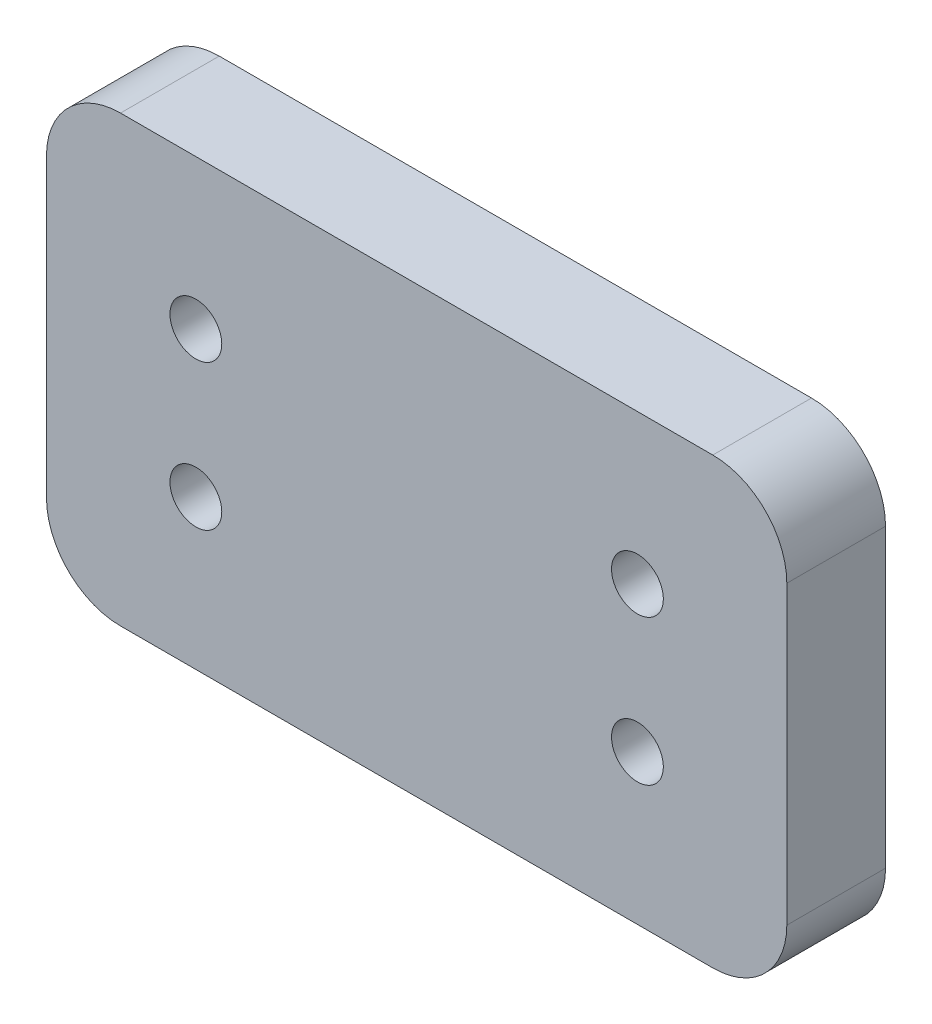
ISO-10303-21;
HEADER;
FILE_DESCRIPTION(('STEP AP214'),'2;1');
FILE_NAME('part.step','',(''),(''),'','','');
FILE_SCHEMA(('AUTOMOTIVE_DESIGN { 1 0 10303 214 1 1 1 1 }'));
ENDSEC;
DATA;
#1=APPLICATION_CONTEXT('core data for automotive mechanical design processes');
#2=APPLICATION_PROTOCOL_DEFINITION('international standard','automotive_design',2000,#1);
#3=PRODUCT_CONTEXT('',#1,'mechanical');
#4=PRODUCT('Part','Part','',(#3));
#5=PRODUCT_RELATED_PRODUCT_CATEGORY('part','',(#4));
#6=PRODUCT_DEFINITION_FORMATION('','',#4);
#7=PRODUCT_DEFINITION_CONTEXT('part definition',#1,'design');
#8=PRODUCT_DEFINITION('design','',#6,#7);
#9=PRODUCT_DEFINITION_SHAPE('','',#8);
#10=(LENGTH_UNIT() NAMED_UNIT(*) SI_UNIT(.MILLI.,.METRE.));
#11=(NAMED_UNIT(*) PLANE_ANGLE_UNIT() SI_UNIT($,.RADIAN.));
#12=(NAMED_UNIT(*) SI_UNIT($,.STERADIAN.) SOLID_ANGLE_UNIT());
#13=UNCERTAINTY_MEASURE_WITH_UNIT(LENGTH_MEASURE(1.E-05),#10,'distance_accuracy_value','');
#14=(GEOMETRIC_REPRESENTATION_CONTEXT(3) GLOBAL_UNCERTAINTY_ASSIGNED_CONTEXT((#13)) GLOBAL_UNIT_ASSIGNED_CONTEXT((#10,
#11,#12)) REPRESENTATION_CONTEXT('',''));
#15=CARTESIAN_POINT('',(0.,0.,0.));
#16=DIRECTION('',(0.,0.,1.));
#17=DIRECTION('',(1.,0.,0.));
#18=AXIS2_PLACEMENT_3D('',#15,#16,#17);
#19=CARTESIAN_POINT('',(0.,0.,4.));
#20=DIRECTION('',(1.,0.,0.));
#21=DIRECTION('',(0.,0.,-1.));
#22=AXIS2_PLACEMENT_3D('',#19,#20,#21);
#23=PLANE('',#22);
#24=DIRECTION('',(0.,-1.,0.));
#25=VECTOR('',#24,1.);
#26=CARTESIAN_POINT('',(0.,0.,0.));
#27=LINE('',#26,#25);
#28=CARTESIAN_POINT('',(0.,15.,0.));
#29=VERTEX_POINT('',#28);
#30=CARTESIAN_POINT('',(0.,3.,0.));
#31=VERTEX_POINT('',#30);
#32=EDGE_CURVE('E136',#29,#31,#27,.T.);
#33=ORIENTED_EDGE('',*,*,#32,.T.);
#34=DIRECTION('',(0.,0.,-1.));
#35=VECTOR('',#34,1.);
#36=CARTESIAN_POINT('',(0.,3.,4.));
#37=LINE('',#36,#35);
#38=CARTESIAN_POINT('',(0.,3.,4.));
#39=VERTEX_POINT('',#38);
#40=EDGE_CURVE('E111',#31,#39,#37,.F.);
#41=ORIENTED_EDGE('',*,*,#40,.T.);
#42=DIRECTION('',(0.,-1.,0.));
#43=VECTOR('',#42,1.);
#44=CARTESIAN_POINT('',(0.,0.,4.));
#45=LINE('',#44,#43);
#46=CARTESIAN_POINT('',(0.,15.,4.));
#47=VERTEX_POINT('',#46);
#48=EDGE_CURVE('E149',#47,#39,#45,.T.);
#49=ORIENTED_EDGE('',*,*,#48,.F.);
#50=DIRECTION('',(0.,0.,-1.));
#51=VECTOR('',#50,1.);
#52=CARTESIAN_POINT('',(0.,15.,4.));
#53=LINE('',#52,#51);
#54=EDGE_CURVE('E117',#47,#29,#53,.T.);
#55=ORIENTED_EDGE('',*,*,#54,.T.);
#56=EDGE_LOOP('',(#33,#41,#49,#55));
#57=FACE_BOUND('',#56,.T.);
#58=ADVANCED_FACE('F39',(#57),#23,.F.);
#59=CARTESIAN_POINT('',(0.,0.,4.));
#60=DIRECTION('',(0.,1.,0.));
#61=DIRECTION('',(0.,0.,1.));
#62=AXIS2_PLACEMENT_3D('',#59,#60,#61);
#63=PLANE('',#62);
#64=DIRECTION('',(1.,0.,0.));
#65=VECTOR('',#64,1.);
#66=CARTESIAN_POINT('',(0.,0.,4.));
#67=LINE('',#66,#65);
#68=CARTESIAN_POINT('',(3.,0.,4.));
#69=VERTEX_POINT('',#68);
#70=CARTESIAN_POINT('',(27.,0.,4.));
#71=VERTEX_POINT('',#70);
#72=EDGE_CURVE('E127',#69,#71,#67,.T.);
#73=ORIENTED_EDGE('',*,*,#72,.F.);
#74=DIRECTION('',(0.,0.,-1.));
#75=VECTOR('',#74,1.);
#76=CARTESIAN_POINT('',(3.,0.,4.));
#77=LINE('',#76,#75);
#78=CARTESIAN_POINT('',(3.,0.,0.));
#79=VERTEX_POINT('',#78);
#80=EDGE_CURVE('E110',#69,#79,#77,.T.);
#81=ORIENTED_EDGE('',*,*,#80,.T.);
#82=DIRECTION('',(1.,0.,0.));
#83=VECTOR('',#82,1.);
#84=CARTESIAN_POINT('',(0.,0.,0.));
#85=LINE('',#84,#83);
#86=CARTESIAN_POINT('',(27.,0.,0.));
#87=VERTEX_POINT('',#86);
#88=EDGE_CURVE('E124',#79,#87,#85,.T.);
#89=ORIENTED_EDGE('',*,*,#88,.T.);
#90=DIRECTION('',(0.,0.,-1.));
#91=VECTOR('',#90,1.);
#92=CARTESIAN_POINT('',(27.,0.,4.));
#93=LINE('',#92,#91);
#94=EDGE_CURVE('E130',#87,#71,#93,.F.);
#95=ORIENTED_EDGE('',*,*,#94,.T.);
#96=EDGE_LOOP('',(#73,#81,#89,#95));
#97=FACE_BOUND('',#96,.T.);
#98=ADVANCED_FACE('F123',(#97),#63,.F.);
#99=CARTESIAN_POINT('',(30.,0.,4.));
#100=DIRECTION('',(-1.,0.,0.));
#101=DIRECTION('',(0.,0.,1.));
#102=AXIS2_PLACEMENT_3D('',#99,#100,#101);
#103=PLANE('',#102);
#104=DIRECTION('',(0.,1.,0.));
#105=VECTOR('',#104,1.);
#106=CARTESIAN_POINT('',(30.,0.,4.));
#107=LINE('',#106,#105);
#108=CARTESIAN_POINT('',(30.,3.,4.));
#109=VERTEX_POINT('',#108);
#110=CARTESIAN_POINT('',(30.,15.,4.));
#111=VERTEX_POINT('',#110);
#112=EDGE_CURVE('E185',#109,#111,#107,.T.);
#113=ORIENTED_EDGE('',*,*,#112,.F.);
#114=DIRECTION('',(0.,0.,-1.));
#115=VECTOR('',#114,1.);
#116=CARTESIAN_POINT('',(30.,3.,4.));
#117=LINE('',#116,#115);
#118=CARTESIAN_POINT('',(30.,3.,0.));
#119=VERTEX_POINT('',#118);
#120=EDGE_CURVE('E179',#109,#119,#117,.T.);
#121=ORIENTED_EDGE('',*,*,#120,.T.);
#122=DIRECTION('',(0.,1.,0.));
#123=VECTOR('',#122,1.);
#124=CARTESIAN_POINT('',(30.,0.,0.));
#125=LINE('',#124,#123);
#126=CARTESIAN_POINT('',(30.,15.,0.));
#127=VERTEX_POINT('',#126);
#128=EDGE_CURVE('E135',#119,#127,#125,.T.);
#129=ORIENTED_EDGE('',*,*,#128,.T.);
#130=DIRECTION('',(0.,0.,-1.));
#131=VECTOR('',#130,1.);
#132=CARTESIAN_POINT('',(30.,15.,4.));
#133=LINE('',#132,#131);
#134=EDGE_CURVE('E176',#127,#111,#133,.F.);
#135=ORIENTED_EDGE('',*,*,#134,.T.);
#136=EDGE_LOOP('',(#113,#121,#129,#135));
#137=FACE_BOUND('',#136,.T.);
#138=ADVANCED_FACE('F260',(#137),#103,.F.);
#139=CARTESIAN_POINT('',(0.,18.,4.));
#140=DIRECTION('',(0.,-1.,0.));
#141=DIRECTION('',(0.,0.,-1.));
#142=AXIS2_PLACEMENT_3D('',#139,#140,#141);
#143=PLANE('',#142);
#144=DIRECTION('',(-1.,0.,0.));
#145=VECTOR('',#144,1.);
#146=CARTESIAN_POINT('',(0.,18.,4.));
#147=LINE('',#146,#145);
#148=CARTESIAN_POINT('',(27.,18.,4.));
#149=VERTEX_POINT('',#148);
#150=CARTESIAN_POINT('',(3.,18.,4.));
#151=VERTEX_POINT('',#150);
#152=EDGE_CURVE('E151',#149,#151,#147,.T.);
#153=ORIENTED_EDGE('',*,*,#152,.F.);
#154=DIRECTION('',(0.,0.,-1.));
#155=VECTOR('',#154,1.);
#156=CARTESIAN_POINT('',(27.,18.,4.));
#157=LINE('',#156,#155);
#158=CARTESIAN_POINT('',(27.,18.,0.));
#159=VERTEX_POINT('',#158);
#160=EDGE_CURVE('E11',#149,#159,#157,.T.);
#161=ORIENTED_EDGE('',*,*,#160,.T.);
#162=DIRECTION('',(-1.,0.,0.));
#163=VECTOR('',#162,1.);
#164=CARTESIAN_POINT('',(0.,18.,0.));
#165=LINE('',#164,#163);
#166=CARTESIAN_POINT('',(3.,18.,0.));
#167=VERTEX_POINT('',#166);
#168=EDGE_CURVE('E141',#159,#167,#165,.T.);
#169=ORIENTED_EDGE('',*,*,#168,.T.);
#170=DIRECTION('',(0.,0.,-1.));
#171=VECTOR('',#170,1.);
#172=CARTESIAN_POINT('',(3.,18.,4.));
#173=LINE('',#172,#171);
#174=EDGE_CURVE('E48',#167,#151,#173,.F.);
#175=ORIENTED_EDGE('',*,*,#174,.T.);
#176=EDGE_LOOP('',(#153,#161,#169,#175));
#177=FACE_BOUND('',#176,.T.);
#178=ADVANCED_FACE('F239',(#177),#143,.F.);
#179=CARTESIAN_POINT('',(0.,0.,4.));
#180=DIRECTION('',(0.,0.,-1.));
#181=DIRECTION('',(-1.,0.,0.));
#182=AXIS2_PLACEMENT_3D('',#179,#180,#181);
#183=PLANE('',#182);
#184=CARTESIAN_POINT('',(6.053,6.053,4.));
#185=DIRECTION('',(0.,0.,1.));
#186=DIRECTION('',(1.,0.,0.));
#187=AXIS2_PLACEMENT_3D('',#184,#185,#186);
#188=CIRCLE('',#187,1.05);
#189=CARTESIAN_POINT('',(7.103,6.053,4.));
#190=VERTEX_POINT('',#189);
#191=EDGE_CURVE('E211',#190,#190,#188,.T.);
#192=ORIENTED_EDGE('',*,*,#191,.F.);
#193=EDGE_LOOP('',(#192));
#194=FACE_BOUND('',#193,.T.);
#195=CARTESIAN_POINT('',(23.947,11.947,4.));
#196=DIRECTION('',(0.,0.,1.));
#197=DIRECTION('',(1.,0.,0.));
#198=AXIS2_PLACEMENT_3D('',#195,#196,#197);
#199=CIRCLE('',#198,1.05);
#200=CARTESIAN_POINT('',(24.997,11.947,4.));
#201=VERTEX_POINT('',#200);
#202=EDGE_CURVE('E202',#201,#201,#199,.T.);
#203=ORIENTED_EDGE('',*,*,#202,.F.);
#204=EDGE_LOOP('',(#203));
#205=FACE_BOUND('',#204,.T.);
#206=CARTESIAN_POINT('',(23.947,6.053,4.));
#207=DIRECTION('',(0.,0.,1.));
#208=DIRECTION('',(1.,0.,0.));
#209=AXIS2_PLACEMENT_3D('',#206,#207,#208);
#210=CIRCLE('',#209,1.05);
#211=CARTESIAN_POINT('',(24.997,6.053,4.));
#212=VERTEX_POINT('',#211);
#213=EDGE_CURVE('E218',#212,#212,#210,.T.);
#214=ORIENTED_EDGE('',*,*,#213,.F.);
#215=EDGE_LOOP('',(#214));
#216=FACE_BOUND('',#215,.T.);
#217=CARTESIAN_POINT('',(6.053,11.947,4.));
#218=DIRECTION('',(0.,0.,1.));
#219=DIRECTION('',(1.,0.,0.));
#220=AXIS2_PLACEMENT_3D('',#217,#218,#219);
#221=CIRCLE('',#220,1.05);
#222=CARTESIAN_POINT('',(7.103,11.947,4.));
#223=VERTEX_POINT('',#222);
#224=EDGE_CURVE('E194',#223,#223,#221,.T.);
#225=ORIENTED_EDGE('',*,*,#224,.F.);
#226=EDGE_LOOP('',(#225));
#227=FACE_BOUND('',#226,.T.);
#228=ORIENTED_EDGE('',*,*,#48,.T.);
#229=CARTESIAN_POINT('',(3.,3.,4.));
#230=DIRECTION('',(0.,0.,-1.));
#231=DIRECTION('',(-1.,0.,0.));
#232=AXIS2_PLACEMENT_3D('',#229,#230,#231);
#233=CIRCLE('',#232,3.);
#234=EDGE_CURVE('E173',#39,#69,#233,.F.);
#235=ORIENTED_EDGE('',*,*,#234,.T.);
#236=ORIENTED_EDGE('',*,*,#72,.T.);
#237=CARTESIAN_POINT('',(27.,3.,4.));
#238=DIRECTION('',(0.,0.,-1.));
#239=DIRECTION('',(-1.,0.,0.));
#240=AXIS2_PLACEMENT_3D('',#237,#238,#239);
#241=CIRCLE('',#240,3.);
#242=EDGE_CURVE('E170',#71,#109,#241,.F.);
#243=ORIENTED_EDGE('',*,*,#242,.T.);
#244=ORIENTED_EDGE('',*,*,#112,.T.);
#245=CARTESIAN_POINT('',(27.,15.,4.));
#246=DIRECTION('',(0.,0.,-1.));
#247=DIRECTION('',(-1.,0.,0.));
#248=AXIS2_PLACEMENT_3D('',#245,#246,#247);
#249=CIRCLE('',#248,3.);
#250=EDGE_CURVE('E61',#111,#149,#249,.F.);
#251=ORIENTED_EDGE('',*,*,#250,.T.);
#252=ORIENTED_EDGE('',*,*,#152,.T.);
#253=CARTESIAN_POINT('',(3.,15.,4.));
#254=DIRECTION('',(0.,0.,-1.));
#255=DIRECTION('',(-1.,0.,0.));
#256=AXIS2_PLACEMENT_3D('',#253,#254,#255);
#257=CIRCLE('',#256,3.);
#258=EDGE_CURVE('E165',#151,#47,#257,.F.);
#259=ORIENTED_EDGE('',*,*,#258,.T.);
#260=EDGE_LOOP('',(#228,#235,#236,#243,#244,#251,#252,#259));
#261=FACE_BOUND('',#260,.T.);
#262=ADVANCED_FACE('F236',(#194,#205,#216,#227,#261),#183,.F.);
#263=CARTESIAN_POINT('',(0.,0.,0.));
#264=DIRECTION('',(0.,0.,-1.));
#265=DIRECTION('',(-1.,0.,0.));
#266=AXIS2_PLACEMENT_3D('',#263,#264,#265);
#267=PLANE('',#266);
#268=CARTESIAN_POINT('',(6.053,6.053,0.));
#269=DIRECTION('',(0.,0.,1.));
#270=DIRECTION('',(1.,0.,0.));
#271=AXIS2_PLACEMENT_3D('',#268,#269,#270);
#272=CIRCLE('',#271,1.05);
#273=CARTESIAN_POINT('',(7.103,6.053,0.));
#274=VERTEX_POINT('',#273);
#275=EDGE_CURVE('E198',#274,#274,#272,.T.);
#276=ORIENTED_EDGE('',*,*,#275,.T.);
#277=EDGE_LOOP('',(#276));
#278=FACE_BOUND('',#277,.T.);
#279=CARTESIAN_POINT('',(23.947,11.947,0.));
#280=DIRECTION('',(0.,0.,1.));
#281=DIRECTION('',(1.,0.,0.));
#282=AXIS2_PLACEMENT_3D('',#279,#280,#281);
#283=CIRCLE('',#282,1.05);
#284=CARTESIAN_POINT('',(24.997,11.947,0.));
#285=VERTEX_POINT('',#284);
#286=EDGE_CURVE('E206',#285,#285,#283,.T.);
#287=ORIENTED_EDGE('',*,*,#286,.T.);
#288=EDGE_LOOP('',(#287));
#289=FACE_BOUND('',#288,.T.);
#290=CARTESIAN_POINT('',(23.947,6.053,0.));
#291=DIRECTION('',(0.,0.,1.));
#292=DIRECTION('',(1.,0.,0.));
#293=AXIS2_PLACEMENT_3D('',#290,#291,#292);
#294=CIRCLE('',#293,1.05);
#295=CARTESIAN_POINT('',(24.997,6.053,0.));
#296=VERTEX_POINT('',#295);
#297=EDGE_CURVE('E207',#296,#296,#294,.T.);
#298=ORIENTED_EDGE('',*,*,#297,.T.);
#299=EDGE_LOOP('',(#298));
#300=FACE_BOUND('',#299,.T.);
#301=CARTESIAN_POINT('',(6.053,11.947,0.));
#302=DIRECTION('',(0.,0.,1.));
#303=DIRECTION('',(1.,0.,0.));
#304=AXIS2_PLACEMENT_3D('',#301,#302,#303);
#305=CIRCLE('',#304,1.05);
#306=CARTESIAN_POINT('',(7.103,11.947,0.));
#307=VERTEX_POINT('',#306);
#308=EDGE_CURVE('E143',#307,#307,#305,.T.);
#309=ORIENTED_EDGE('',*,*,#308,.T.);
#310=EDGE_LOOP('',(#309));
#311=FACE_BOUND('',#310,.T.);
#312=ORIENTED_EDGE('',*,*,#88,.F.);
#313=CARTESIAN_POINT('',(3.,3.,0.));
#314=DIRECTION('',(0.,0.,-1.));
#315=DIRECTION('',(-1.,0.,0.));
#316=AXIS2_PLACEMENT_3D('',#313,#314,#315);
#317=CIRCLE('',#316,3.);
#318=EDGE_CURVE('E106',#79,#31,#317,.T.);
#319=ORIENTED_EDGE('',*,*,#318,.T.);
#320=ORIENTED_EDGE('',*,*,#32,.F.);
#321=CARTESIAN_POINT('',(3.,15.,0.));
#322=DIRECTION('',(0.,0.,-1.));
#323=DIRECTION('',(-1.,0.,0.));
#324=AXIS2_PLACEMENT_3D('',#321,#322,#323);
#325=CIRCLE('',#324,3.);
#326=EDGE_CURVE('E129',#29,#167,#325,.T.);
#327=ORIENTED_EDGE('',*,*,#326,.T.);
#328=ORIENTED_EDGE('',*,*,#168,.F.);
#329=CARTESIAN_POINT('',(27.,15.,0.));
#330=DIRECTION('',(0.,0.,-1.));
#331=DIRECTION('',(-1.,0.,0.));
#332=AXIS2_PLACEMENT_3D('',#329,#330,#331);
#333=CIRCLE('',#332,3.);
#334=EDGE_CURVE('E155',#159,#127,#333,.T.);
#335=ORIENTED_EDGE('',*,*,#334,.T.);
#336=ORIENTED_EDGE('',*,*,#128,.F.);
#337=CARTESIAN_POINT('',(27.,3.,0.));
#338=DIRECTION('',(0.,0.,-1.));
#339=DIRECTION('',(-1.,0.,0.));
#340=AXIS2_PLACEMENT_3D('',#337,#338,#339);
#341=CIRCLE('',#340,3.);
#342=EDGE_CURVE('E118',#119,#87,#341,.T.);
#343=ORIENTED_EDGE('',*,*,#342,.T.);
#344=EDGE_LOOP('',(#312,#319,#320,#327,#328,#335,#336,#343));
#345=FACE_BOUND('',#344,.T.);
#346=ADVANCED_FACE('F132',(#278,#289,#300,#311,#345),#267,.T.);
#347=CARTESIAN_POINT('',(3.,3.,4.));
#348=DIRECTION('',(0.,0.,-1.));
#349=DIRECTION('',(-1.,0.,0.));
#350=AXIS2_PLACEMENT_3D('',#347,#348,#349);
#351=CYLINDRICAL_SURFACE('',#350,3.);
#352=ORIENTED_EDGE('',*,*,#234,.F.);
#353=ORIENTED_EDGE('',*,*,#40,.F.);
#354=ORIENTED_EDGE('',*,*,#318,.F.);
#355=ORIENTED_EDGE('',*,*,#80,.F.);
#356=EDGE_LOOP('',(#352,#353,#354,#355));
#357=FACE_BOUND('',#356,.T.);
#358=ADVANCED_FACE('F109',(#357),#351,.T.);
#359=CARTESIAN_POINT('',(27.,3.,4.));
#360=DIRECTION('',(0.,0.,-1.));
#361=DIRECTION('',(-1.,0.,0.));
#362=AXIS2_PLACEMENT_3D('',#359,#360,#361);
#363=CYLINDRICAL_SURFACE('',#362,3.);
#364=ORIENTED_EDGE('',*,*,#242,.F.);
#365=ORIENTED_EDGE('',*,*,#94,.F.);
#366=ORIENTED_EDGE('',*,*,#342,.F.);
#367=ORIENTED_EDGE('',*,*,#120,.F.);
#368=EDGE_LOOP('',(#364,#365,#366,#367));
#369=FACE_BOUND('',#368,.T.);
#370=ADVANCED_FACE('F266',(#369),#363,.T.);
#371=CARTESIAN_POINT('',(27.,15.,4.));
#372=DIRECTION('',(0.,0.,-1.));
#373=DIRECTION('',(-1.,0.,0.));
#374=AXIS2_PLACEMENT_3D('',#371,#372,#373);
#375=CYLINDRICAL_SURFACE('',#374,3.);
#376=ORIENTED_EDGE('',*,*,#250,.F.);
#377=ORIENTED_EDGE('',*,*,#134,.F.);
#378=ORIENTED_EDGE('',*,*,#334,.F.);
#379=ORIENTED_EDGE('',*,*,#160,.F.);
#380=EDGE_LOOP('',(#376,#377,#378,#379));
#381=FACE_BOUND('',#380,.T.);
#382=ADVANCED_FACE('F250',(#381),#375,.T.);
#383=CARTESIAN_POINT('',(3.,15.,4.));
#384=DIRECTION('',(0.,0.,-1.));
#385=DIRECTION('',(-1.,0.,0.));
#386=AXIS2_PLACEMENT_3D('',#383,#384,#385);
#387=CYLINDRICAL_SURFACE('',#386,3.);
#388=ORIENTED_EDGE('',*,*,#258,.F.);
#389=ORIENTED_EDGE('',*,*,#174,.F.);
#390=ORIENTED_EDGE('',*,*,#326,.F.);
#391=ORIENTED_EDGE('',*,*,#54,.F.);
#392=EDGE_LOOP('',(#388,#389,#390,#391));
#393=FACE_BOUND('',#392,.T.);
#394=ADVANCED_FACE('F41',(#393),#387,.T.);
#395=CARTESIAN_POINT('',(6.053,11.947,0.));
#396=DIRECTION('',(0.,0.,1.));
#397=DIRECTION('',(1.,0.,0.));
#398=AXIS2_PLACEMENT_3D('',#395,#396,#397);
#399=CYLINDRICAL_SURFACE('',#398,1.05);
#400=ORIENTED_EDGE('',*,*,#308,.F.);
#401=EDGE_LOOP('',(#400));
#402=FACE_BOUND('',#401,.T.);
#403=ORIENTED_EDGE('',*,*,#224,.T.);
#404=EDGE_LOOP('',(#403));
#405=FACE_BOUND('',#404,.T.);
#406=ADVANCED_FACE('F232',(#402,#405),#399,.F.);
#407=CARTESIAN_POINT('',(23.947,6.053,0.));
#408=DIRECTION('',(0.,0.,1.));
#409=DIRECTION('',(1.,0.,0.));
#410=AXIS2_PLACEMENT_3D('',#407,#408,#409);
#411=CYLINDRICAL_SURFACE('',#410,1.05);
#412=ORIENTED_EDGE('',*,*,#297,.F.);
#413=EDGE_LOOP('',(#412));
#414=FACE_BOUND('',#413,.T.);
#415=ORIENTED_EDGE('',*,*,#213,.T.);
#416=EDGE_LOOP('',(#415));
#417=FACE_BOUND('',#416,.T.);
#418=ADVANCED_FACE('F228',(#414,#417),#411,.F.);
#419=CARTESIAN_POINT('',(23.947,11.947,0.));
#420=DIRECTION('',(0.,0.,1.));
#421=DIRECTION('',(1.,0.,0.));
#422=AXIS2_PLACEMENT_3D('',#419,#420,#421);
#423=CYLINDRICAL_SURFACE('',#422,1.05);
#424=ORIENTED_EDGE('',*,*,#286,.F.);
#425=EDGE_LOOP('',(#424));
#426=FACE_BOUND('',#425,.T.);
#427=ORIENTED_EDGE('',*,*,#202,.T.);
#428=EDGE_LOOP('',(#427));
#429=FACE_BOUND('',#428,.T.);
#430=ADVANCED_FACE('F231',(#426,#429),#423,.F.);
#431=CARTESIAN_POINT('',(6.053,6.053,0.));
#432=DIRECTION('',(0.,0.,1.));
#433=DIRECTION('',(1.,0.,0.));
#434=AXIS2_PLACEMENT_3D('',#431,#432,#433);
#435=CYLINDRICAL_SURFACE('',#434,1.05);
#436=ORIENTED_EDGE('',*,*,#275,.F.);
#437=EDGE_LOOP('',(#436));
#438=FACE_BOUND('',#437,.T.);
#439=ORIENTED_EDGE('',*,*,#191,.T.);
#440=EDGE_LOOP('',(#439));
#441=FACE_BOUND('',#440,.T.);
#442=ADVANCED_FACE('F298',(#438,#441),#435,.F.);
#443=CLOSED_SHELL('',(#58,#98,#138,#178,#262,#346,#358,#370,#382,#394,#406,#418,#430,#442));
#444=MANIFOLD_SOLID_BREP('B2',#443);
#445=ADVANCED_BREP_SHAPE_REPRESENTATION('',(#18,#444),#14);
#446=SHAPE_DEFINITION_REPRESENTATION(#9,#445);
ENDSEC;
END-ISO-10303-21;
